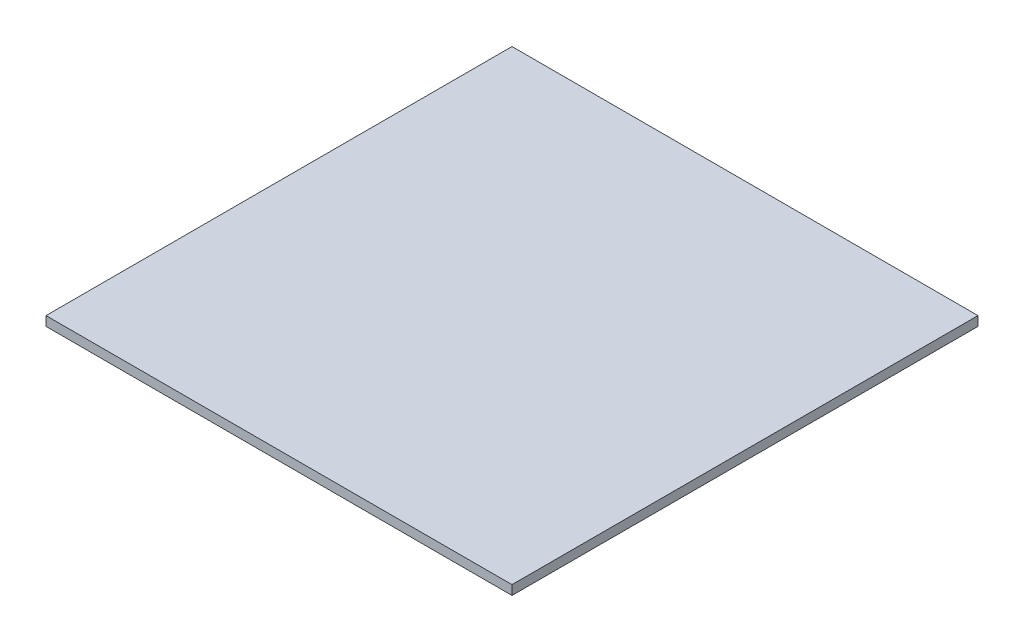
ISO-10303-21;
HEADER;
FILE_DESCRIPTION(('STEP AP214'),'2;1');
FILE_NAME('part.step','',(''),(''),'','','');
FILE_SCHEMA(('AUTOMOTIVE_DESIGN { 1 0 10303 214 1 1 1 1 }'));
ENDSEC;
DATA;
#1=APPLICATION_CONTEXT('core data for automotive mechanical design processes');
#2=APPLICATION_PROTOCOL_DEFINITION('international standard','automotive_design',2000,#1);
#3=PRODUCT_CONTEXT('',#1,'mechanical');
#4=PRODUCT('Part','Part','',(#3));
#5=PRODUCT_RELATED_PRODUCT_CATEGORY('part','',(#4));
#6=PRODUCT_DEFINITION_FORMATION('','',#4);
#7=PRODUCT_DEFINITION_CONTEXT('part definition',#1,'design');
#8=PRODUCT_DEFINITION('design','',#6,#7);
#9=PRODUCT_DEFINITION_SHAPE('','',#8);
#10=(LENGTH_UNIT() NAMED_UNIT(*) SI_UNIT(.MILLI.,.METRE.));
#11=(NAMED_UNIT(*) PLANE_ANGLE_UNIT() SI_UNIT($,.RADIAN.));
#12=(NAMED_UNIT(*) SI_UNIT($,.STERADIAN.) SOLID_ANGLE_UNIT());
#13=UNCERTAINTY_MEASURE_WITH_UNIT(LENGTH_MEASURE(1.E-05),#10,'distance_accuracy_value','');
#14=(GEOMETRIC_REPRESENTATION_CONTEXT(3) GLOBAL_UNCERTAINTY_ASSIGNED_CONTEXT((#13)) GLOBAL_UNIT_ASSIGNED_CONTEXT((#10,
#11,#12)) REPRESENTATION_CONTEXT('',''));
#15=CARTESIAN_POINT('',(0.,0.,0.));
#16=DIRECTION('',(0.,0.,1.));
#17=DIRECTION('',(1.,0.,0.));
#18=AXIS2_PLACEMENT_3D('',#15,#16,#17);
#19=CARTESIAN_POINT('',(0.,3.02124999484224,0.));
#20=DIRECTION('',(1.,0.,0.));
#21=DIRECTION('',(0.,0.,-1.));
#22=AXIS2_PLACEMENT_3D('',#19,#20,#21);
#23=PLANE('',#22);
#24=DIRECTION('',(0.,0.,1.));
#25=VECTOR('',#24,1.);
#26=CARTESIAN_POINT('',(0.,0.,0.));
#27=LINE('',#26,#25);
#28=CARTESIAN_POINT('',(0.,0.,-150.));
#29=VERTEX_POINT('',#28);
#30=CARTESIAN_POINT('',(0.,0.,0.));
#31=VERTEX_POINT('',#30);
#32=EDGE_CURVE('E98',#29,#31,#27,.T.);
#33=ORIENTED_EDGE('',*,*,#32,.T.);
#34=DIRECTION('',(0.,-1.,0.));
#35=VECTOR('',#34,1.);
#36=CARTESIAN_POINT('',(0.,3.02124999484224,0.));
#37=LINE('',#36,#35);
#38=CARTESIAN_POINT('',(0.,3.02124999484224,0.));
#39=VERTEX_POINT('',#38);
#40=EDGE_CURVE('E11',#39,#31,#37,.T.);
#41=ORIENTED_EDGE('',*,*,#40,.F.);
#42=DIRECTION('',(0.,0.,1.));
#43=VECTOR('',#42,1.);
#44=CARTESIAN_POINT('',(0.,3.02124999484224,0.));
#45=LINE('',#44,#43);
#46=CARTESIAN_POINT('',(0.,3.02124999484224,-150.));
#47=VERTEX_POINT('',#46);
#48=EDGE_CURVE('E86',#47,#39,#45,.T.);
#49=ORIENTED_EDGE('',*,*,#48,.F.);
#50=DIRECTION('',(0.,-1.,0.));
#51=VECTOR('',#50,1.);
#52=CARTESIAN_POINT('',(0.,3.02124999484224,-150.));
#53=LINE('',#52,#51);
#54=EDGE_CURVE('E94',#47,#29,#53,.T.);
#55=ORIENTED_EDGE('',*,*,#54,.T.);
#56=EDGE_LOOP('',(#33,#41,#49,#55));
#57=FACE_BOUND('',#56,.T.);
#58=ADVANCED_FACE('F35',(#57),#23,.F.);
#59=CARTESIAN_POINT('',(0.,3.02124999484224,0.));
#60=DIRECTION('',(0.,0.,-1.));
#61=DIRECTION('',(-1.,0.,0.));
#62=AXIS2_PLACEMENT_3D('',#59,#60,#61);
#63=PLANE('',#62);
#64=DIRECTION('',(1.,0.,0.));
#65=VECTOR('',#64,1.);
#66=CARTESIAN_POINT('',(0.,0.,0.));
#67=LINE('',#66,#65);
#68=CARTESIAN_POINT('',(150.,0.,0.));
#69=VERTEX_POINT('',#68);
#70=EDGE_CURVE('E90',#31,#69,#67,.T.);
#71=ORIENTED_EDGE('',*,*,#70,.T.);
#72=DIRECTION('',(0.,-1.,0.));
#73=VECTOR('',#72,1.);
#74=CARTESIAN_POINT('',(150.,3.02124999484224,0.));
#75=LINE('',#74,#73);
#76=CARTESIAN_POINT('',(150.,3.02124999484224,0.));
#77=VERTEX_POINT('',#76);
#78=EDGE_CURVE('E43',#77,#69,#75,.T.);
#79=ORIENTED_EDGE('',*,*,#78,.F.);
#80=DIRECTION('',(1.,0.,0.));
#81=VECTOR('',#80,1.);
#82=CARTESIAN_POINT('',(0.,3.02124999484224,0.));
#83=LINE('',#82,#81);
#84=EDGE_CURVE('E81',#39,#77,#83,.T.);
#85=ORIENTED_EDGE('',*,*,#84,.F.);
#86=ORIENTED_EDGE('',*,*,#40,.T.);
#87=EDGE_LOOP('',(#71,#79,#85,#86));
#88=FACE_BOUND('',#87,.T.);
#89=ADVANCED_FACE('F89',(#88),#63,.F.);
#90=CARTESIAN_POINT('',(150.,3.02124999484224,0.));
#91=DIRECTION('',(-1.,0.,0.));
#92=DIRECTION('',(0.,0.,1.));
#93=AXIS2_PLACEMENT_3D('',#90,#91,#92);
#94=PLANE('',#93);
#95=DIRECTION('',(0.,0.,-1.));
#96=VECTOR('',#95,1.);
#97=CARTESIAN_POINT('',(150.,0.,0.));
#98=LINE('',#97,#96);
#99=CARTESIAN_POINT('',(150.,0.,-150.));
#100=VERTEX_POINT('',#99);
#101=EDGE_CURVE('E68',#69,#100,#98,.T.);
#102=ORIENTED_EDGE('',*,*,#101,.T.);
#103=DIRECTION('',(0.,-1.,0.));
#104=VECTOR('',#103,1.);
#105=CARTESIAN_POINT('',(150.,3.02124999484224,-150.));
#106=LINE('',#105,#104);
#107=CARTESIAN_POINT('',(150.,3.02124999484224,-150.));
#108=VERTEX_POINT('',#107);
#109=EDGE_CURVE('E91',#108,#100,#106,.T.);
#110=ORIENTED_EDGE('',*,*,#109,.F.);
#111=DIRECTION('',(0.,0.,-1.));
#112=VECTOR('',#111,1.);
#113=CARTESIAN_POINT('',(150.,3.02124999484224,0.));
#114=LINE('',#113,#112);
#115=EDGE_CURVE('E84',#77,#108,#114,.T.);
#116=ORIENTED_EDGE('',*,*,#115,.F.);
#117=ORIENTED_EDGE('',*,*,#78,.T.);
#118=EDGE_LOOP('',(#102,#110,#116,#117));
#119=FACE_BOUND('',#118,.T.);
#120=ADVANCED_FACE('F92',(#119),#94,.F.);
#121=CARTESIAN_POINT('',(0.,3.02124999484224,-150.));
#122=DIRECTION('',(0.,0.,1.));
#123=DIRECTION('',(1.,0.,0.));
#124=AXIS2_PLACEMENT_3D('',#121,#122,#123);
#125=PLANE('',#124);
#126=DIRECTION('',(-1.,0.,0.));
#127=VECTOR('',#126,1.);
#128=CARTESIAN_POINT('',(0.,0.,-150.));
#129=LINE('',#128,#127);
#130=EDGE_CURVE('E74',#100,#29,#129,.T.);
#131=ORIENTED_EDGE('',*,*,#130,.T.);
#132=ORIENTED_EDGE('',*,*,#54,.F.);
#133=DIRECTION('',(-1.,0.,0.));
#134=VECTOR('',#133,1.);
#135=CARTESIAN_POINT('',(0.,3.02124999484224,-150.));
#136=LINE('',#135,#134);
#137=EDGE_CURVE('E51',#108,#47,#136,.T.);
#138=ORIENTED_EDGE('',*,*,#137,.F.);
#139=ORIENTED_EDGE('',*,*,#109,.T.);
#140=EDGE_LOOP('',(#131,#132,#138,#139));
#141=FACE_BOUND('',#140,.T.);
#142=ADVANCED_FACE('F105',(#141),#125,.F.);
#143=CARTESIAN_POINT('',(0.,3.02124999484224,0.));
#144=DIRECTION('',(0.,-1.,0.));
#145=DIRECTION('',(0.,0.,-1.));
#146=AXIS2_PLACEMENT_3D('',#143,#144,#145);
#147=PLANE('',#146);
#148=ORIENTED_EDGE('',*,*,#48,.T.);
#149=ORIENTED_EDGE('',*,*,#84,.T.);
#150=ORIENTED_EDGE('',*,*,#115,.T.);
#151=ORIENTED_EDGE('',*,*,#137,.T.);
#152=EDGE_LOOP('',(#148,#149,#150,#151));
#153=FACE_BOUND('',#152,.T.);
#154=ADVANCED_FACE('F82',(#153),#147,.F.);
#155=CARTESIAN_POINT('',(0.,0.,0.));
#156=DIRECTION('',(0.,-1.,0.));
#157=DIRECTION('',(0.,0.,-1.));
#158=AXIS2_PLACEMENT_3D('',#155,#156,#157);
#159=PLANE('',#158);
#160=ORIENTED_EDGE('',*,*,#32,.F.);
#161=ORIENTED_EDGE('',*,*,#130,.F.);
#162=ORIENTED_EDGE('',*,*,#101,.F.);
#163=ORIENTED_EDGE('',*,*,#70,.F.);
#164=EDGE_LOOP('',(#160,#161,#162,#163));
#165=FACE_BOUND('',#164,.T.);
#166=ADVANCED_FACE('F108',(#165),#159,.T.);
#167=CLOSED_SHELL('',(#58,#89,#120,#142,#154,#166));
#168=MANIFOLD_SOLID_BREP('B2',#167);
#169=ADVANCED_BREP_SHAPE_REPRESENTATION('',(#18,#168),#14);
#170=SHAPE_DEFINITION_REPRESENTATION(#9,#169);
ENDSEC;
END-ISO-10303-21;
